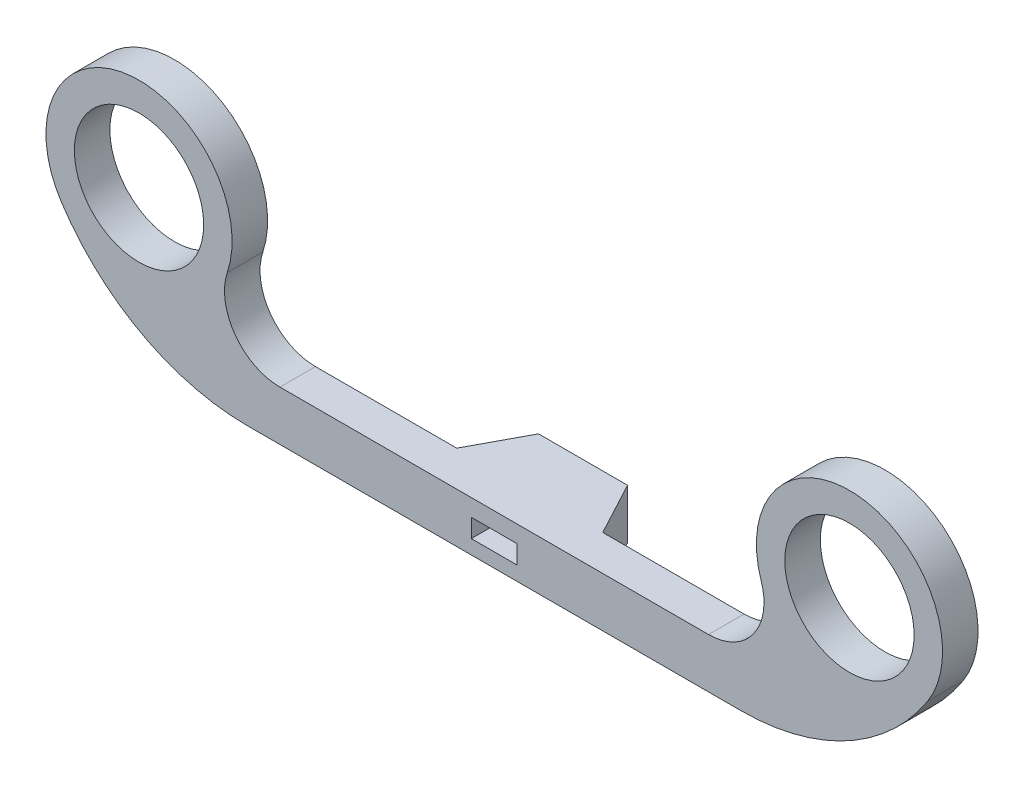
ISO-10303-21;
HEADER;
FILE_DESCRIPTION(('STEP AP214'),'2;1');
FILE_NAME('part.step','',(''),(''),'','','');
FILE_SCHEMA(('AUTOMOTIVE_DESIGN { 1 0 10303 214 1 1 1 1 }'));
ENDSEC;
DATA;
#1=APPLICATION_CONTEXT('core data for automotive mechanical design processes');
#2=APPLICATION_PROTOCOL_DEFINITION('international standard','automotive_design',2000,#1);
#3=PRODUCT_CONTEXT('',#1,'mechanical');
#4=PRODUCT('Part','Part','',(#3));
#5=PRODUCT_RELATED_PRODUCT_CATEGORY('part','',(#4));
#6=PRODUCT_DEFINITION_FORMATION('','',#4);
#7=PRODUCT_DEFINITION_CONTEXT('part definition',#1,'design');
#8=PRODUCT_DEFINITION('design','',#6,#7);
#9=PRODUCT_DEFINITION_SHAPE('','',#8);
#10=(LENGTH_UNIT() NAMED_UNIT(*) SI_UNIT(.MILLI.,.METRE.));
#11=(NAMED_UNIT(*) PLANE_ANGLE_UNIT() SI_UNIT($,.RADIAN.));
#12=(NAMED_UNIT(*) SI_UNIT($,.STERADIAN.) SOLID_ANGLE_UNIT());
#13=UNCERTAINTY_MEASURE_WITH_UNIT(LENGTH_MEASURE(1.E-05),#10,'distance_accuracy_value','');
#14=(GEOMETRIC_REPRESENTATION_CONTEXT(3) GLOBAL_UNCERTAINTY_ASSIGNED_CONTEXT((#13)) GLOBAL_UNIT_ASSIGNED_CONTEXT((#10,
#11,#12)) REPRESENTATION_CONTEXT('',''));
#15=CARTESIAN_POINT('',(0.,0.,0.));
#16=DIRECTION('',(0.,0.,1.));
#17=DIRECTION('',(1.,0.,0.));
#18=AXIS2_PLACEMENT_3D('',#15,#16,#17);
#19=CARTESIAN_POINT('',(-22.0565188033917,38.0288547062897,12.7));
#20=DIRECTION('',(0.,0.,-1.));
#21=DIRECTION('',(-1.,0.,0.));
#22=AXIS2_PLACEMENT_3D('',#19,#20,#21);
#23=CYLINDRICAL_SURFACE('',#22,19.8678547062897);
#24=CARTESIAN_POINT('',(-22.0565188033917,38.0288547062897,9.525));
#25=DIRECTION('',(0.,0.,-1.));
#26=DIRECTION('',(-1.,0.,0.));
#27=AXIS2_PLACEMENT_3D('',#24,#25,#26);
#28=CIRCLE('',#27,19.8678547062897);
#29=CARTESIAN_POINT('',(-22.0565188033917,18.161,9.525));
#30=VERTEX_POINT('',#29);
#31=CARTESIAN_POINT('',(-38.7317946876351,27.2276128881187,9.525));
#32=VERTEX_POINT('',#31);
#33=EDGE_CURVE('E49',#30,#32,#28,.T.);
#34=ORIENTED_EDGE('',*,*,#33,.F.);
#35=DIRECTION('',(0.,0.,-1.));
#36=VECTOR('',#35,1.);
#37=CARTESIAN_POINT('',(-22.0565188033917,18.161,12.7));
#38=LINE('',#37,#36);
#39=CARTESIAN_POINT('',(-22.0565188033917,18.161,12.7));
#40=VERTEX_POINT('',#39);
#41=EDGE_CURVE('E223',#40,#30,#38,.T.);
#42=ORIENTED_EDGE('',*,*,#41,.F.);
#43=CARTESIAN_POINT('',(-22.0565188033917,38.0288547062897,12.7));
#44=DIRECTION('',(0.,0.,1.));
#45=DIRECTION('',(1.,0.,0.));
#46=AXIS2_PLACEMENT_3D('',#43,#44,#45);
#47=CIRCLE('',#46,19.8678547062897);
#48=CARTESIAN_POINT('',(-38.7317946876351,27.2276128881187,12.7));
#49=VERTEX_POINT('',#48);
#50=EDGE_CURVE('E185',#49,#40,#47,.T.);
#51=ORIENTED_EDGE('',*,*,#50,.F.);
#52=DIRECTION('',(0.,0.,-1.));
#53=VECTOR('',#52,1.);
#54=CARTESIAN_POINT('',(-38.7317946876351,27.2276128881187,12.7));
#55=LINE('',#54,#53);
#56=EDGE_CURVE('E202',#49,#32,#55,.T.);
#57=ORIENTED_EDGE('',*,*,#56,.T.);
#58=EDGE_LOOP('',(#34,#42,#51,#57));
#59=FACE_BOUND('',#58,.T.);
#60=ADVANCED_FACE('F35',(#59),#23,.T.);
#61=CARTESIAN_POINT('',(-22.0565188033917,18.161,12.7));
#62=DIRECTION('',(0.,1.,0.));
#63=DIRECTION('',(0.,0.,1.));
#64=AXIS2_PLACEMENT_3D('',#61,#62,#63);
#65=PLANE('',#64);
#66=DIRECTION('',(-1.,0.,0.));
#67=VECTOR('',#66,1.);
#68=CARTESIAN_POINT('',(-46.1574002867593,18.161,9.525));
#69=LINE('',#68,#67);
#70=CARTESIAN_POINT('',(-6.52465554349035,18.161,9.525));
#71=VERTEX_POINT('',#70);
#72=EDGE_CURVE('E152',#71,#30,#69,.T.);
#73=ORIENTED_EDGE('',*,*,#72,.F.);
#74=DIRECTION('',(-0.471463323028111,0.,0.88188567004986));
#75=VECTOR('',#74,1.);
#76=CARTESIAN_POINT('',(-6.52465554349035,18.161,9.525));
#77=LINE('',#76,#75);
#78=CARTESIAN_POINT('',(-3.97858392425832,18.161,4.7625));
#79=VERTEX_POINT('',#78);
#80=EDGE_CURVE('E305',#79,#71,#77,.T.);
#81=ORIENTED_EDGE('',*,*,#80,.F.);
#82=DIRECTION('',(-1.,0.,0.));
#83=VECTOR('',#82,1.);
#84=CARTESIAN_POINT('',(-3.97858392425832,18.161,4.7625));
#85=LINE('',#84,#83);
#86=CARTESIAN_POINT('',(3.97858392425832,18.161,4.7625));
#87=VERTEX_POINT('',#86);
#88=EDGE_CURVE('E309',#87,#79,#85,.T.);
#89=ORIENTED_EDGE('',*,*,#88,.F.);
#90=DIRECTION('',(-0.471463323028111,0.,-0.88188567004986));
#91=VECTOR('',#90,1.);
#92=CARTESIAN_POINT('',(3.97858392425832,18.161,4.7625));
#93=LINE('',#92,#91);
#94=CARTESIAN_POINT('',(6.52465554349035,18.161,9.525));
#95=VERTEX_POINT('',#94);
#96=EDGE_CURVE('E314',#95,#87,#93,.T.);
#97=ORIENTED_EDGE('',*,*,#96,.F.);
#98=DIRECTION('',(-1.,0.,0.));
#99=VECTOR('',#98,1.);
#100=CARTESIAN_POINT('',(6.52465554349035,18.161,9.525));
#101=LINE('',#100,#99);
#102=CARTESIAN_POINT('',(22.0565188033917,18.161,9.525));
#103=VERTEX_POINT('',#102);
#104=EDGE_CURVE('E251',#103,#95,#101,.T.);
#105=ORIENTED_EDGE('',*,*,#104,.F.);
#106=DIRECTION('',(0.,0.,-1.));
#107=VECTOR('',#106,1.);
#108=CARTESIAN_POINT('',(22.0565188033917,18.161,12.7));
#109=LINE('',#108,#107);
#110=CARTESIAN_POINT('',(22.0565188033917,18.161,12.7));
#111=VERTEX_POINT('',#110);
#112=EDGE_CURVE('E220',#111,#103,#109,.T.);
#113=ORIENTED_EDGE('',*,*,#112,.F.);
#114=DIRECTION('',(1.,0.,0.));
#115=VECTOR('',#114,1.);
#116=CARTESIAN_POINT('',(-22.0565188033917,18.161,12.7));
#117=LINE('',#116,#115);
#118=EDGE_CURVE('E188',#40,#111,#117,.T.);
#119=ORIENTED_EDGE('',*,*,#118,.F.);
#120=ORIENTED_EDGE('',*,*,#41,.T.);
#121=EDGE_LOOP('',(#73,#81,#89,#97,#105,#113,#119,#120));
#122=FACE_BOUND('',#121,.T.);
#123=ADVANCED_FACE('F311',(#122),#65,.F.);
#124=CARTESIAN_POINT('',(22.0565188033917,38.0288547062896,12.7));
#125=DIRECTION('',(0.,0.,-1.));
#126=DIRECTION('',(-1.,0.,0.));
#127=AXIS2_PLACEMENT_3D('',#124,#125,#126);
#128=CYLINDRICAL_SURFACE('',#127,19.8678547062896);
#129=CARTESIAN_POINT('',(22.0565188033917,38.0288547062896,9.525));
#130=DIRECTION('',(0.,0.,-1.));
#131=DIRECTION('',(-1.,0.,0.));
#132=AXIS2_PLACEMENT_3D('',#129,#130,#131);
#133=CIRCLE('',#132,19.8678547062896);
#134=CARTESIAN_POINT('',(38.7317946876351,27.2276128881187,9.525));
#135=VERTEX_POINT('',#134);
#136=EDGE_CURVE('E234',#135,#103,#133,.T.);
#137=ORIENTED_EDGE('',*,*,#136,.F.);
#138=DIRECTION('',(0.,0.,-1.));
#139=VECTOR('',#138,1.);
#140=CARTESIAN_POINT('',(38.7317946876351,27.2276128881187,12.7));
#141=LINE('',#140,#139);
#142=CARTESIAN_POINT('',(38.7317946876351,27.2276128881187,12.7));
#143=VERTEX_POINT('',#142);
#144=EDGE_CURVE('E217',#143,#135,#141,.T.);
#145=ORIENTED_EDGE('',*,*,#144,.F.);
#146=CARTESIAN_POINT('',(22.0565188033917,38.0288547062896,12.7));
#147=DIRECTION('',(0.,0.,1.));
#148=DIRECTION('',(1.,0.,0.));
#149=AXIS2_PLACEMENT_3D('',#146,#147,#148);
#150=CIRCLE('',#149,19.8678547062896);
#151=EDGE_CURVE('E190',#111,#143,#150,.T.);
#152=ORIENTED_EDGE('',*,*,#151,.F.);
#153=ORIENTED_EDGE('',*,*,#112,.T.);
#154=EDGE_LOOP('',(#137,#145,#152,#153));
#155=FACE_BOUND('',#154,.T.);
#156=ADVANCED_FACE('F322',(#155),#128,.T.);
#157=CARTESIAN_POINT('',(31.75,31.75,12.7));
#158=DIRECTION('',(0.,0.,-1.));
#159=DIRECTION('',(-1.,0.,0.));
#160=AXIS2_PLACEMENT_3D('',#157,#158,#159);
#161=CYLINDRICAL_SURFACE('',#160,8.3185);
#162=CARTESIAN_POINT('',(31.75,31.75,9.525));
#163=DIRECTION('',(0.,0.,-1.));
#164=DIRECTION('',(-1.,0.,0.));
#165=AXIS2_PLACEMENT_3D('',#162,#163,#164);
#166=CIRCLE('',#165,8.3185);
#167=CARTESIAN_POINT('',(23.8559678373124,29.1267008435075,9.525));
#168=VERTEX_POINT('',#167);
#169=EDGE_CURVE('E260',#168,#135,#166,.T.);
#170=ORIENTED_EDGE('',*,*,#169,.F.);
#171=DIRECTION('',(0.,0.,-1.));
#172=VECTOR('',#171,1.);
#173=CARTESIAN_POINT('',(23.8559678373124,29.1267008435075,12.7));
#174=LINE('',#173,#172);
#175=CARTESIAN_POINT('',(23.8559678373124,29.1267008435075,12.7));
#176=VERTEX_POINT('',#175);
#177=EDGE_CURVE('E214',#176,#168,#174,.T.);
#178=ORIENTED_EDGE('',*,*,#177,.F.);
#179=CARTESIAN_POINT('',(31.75,31.75,12.7));
#180=DIRECTION('',(0.,0.,1.));
#181=DIRECTION('',(1.,0.,0.));
#182=AXIS2_PLACEMENT_3D('',#179,#180,#181);
#183=CIRCLE('',#182,8.3185);
#184=EDGE_CURVE('E192',#143,#176,#183,.T.);
#185=ORIENTED_EDGE('',*,*,#184,.F.);
#186=ORIENTED_EDGE('',*,*,#144,.T.);
#187=EDGE_LOOP('',(#170,#178,#185,#186));
#188=FACE_BOUND('',#187,.T.);
#189=ADVANCED_FACE('F344',(#188),#161,.T.);
#190=CARTESIAN_POINT('',(19.1515658056439,27.5633611424344,12.7));
#191=DIRECTION('',(0.,0.,-1.));
#192=DIRECTION('',(-1.,0.,0.));
#193=AXIS2_PLACEMENT_3D('',#190,#191,#192);
#194=CYLINDRICAL_SURFACE('',#193,4.95736114243437);
#195=CARTESIAN_POINT('',(19.1515658056439,27.5633611424344,9.525));
#196=DIRECTION('',(0.,0.,-1.));
#197=DIRECTION('',(-1.,0.,0.));
#198=AXIS2_PLACEMENT_3D('',#195,#196,#197);
#199=CIRCLE('',#198,4.95736114243437);
#200=CARTESIAN_POINT('',(19.1515658056439,22.606,9.525));
#201=VERTEX_POINT('',#200);
#202=EDGE_CURVE('E258',#201,#168,#199,.F.);
#203=ORIENTED_EDGE('',*,*,#202,.F.);
#204=DIRECTION('',(0.,0.,-1.));
#205=VECTOR('',#204,1.);
#206=CARTESIAN_POINT('',(19.1515658056439,22.606,12.7));
#207=LINE('',#206,#205);
#208=CARTESIAN_POINT('',(19.1515658056439,22.606,12.7));
#209=VERTEX_POINT('',#208);
#210=EDGE_CURVE('E211',#209,#201,#207,.T.);
#211=ORIENTED_EDGE('',*,*,#210,.F.);
#212=CARTESIAN_POINT('',(19.1515658056439,27.5633611424344,12.7));
#213=DIRECTION('',(0.,0.,-1.));
#214=DIRECTION('',(1.,0.,0.));
#215=AXIS2_PLACEMENT_3D('',#212,#213,#214);
#216=CIRCLE('',#215,4.95736114243437);
#217=EDGE_CURVE('E194',#176,#209,#216,.T.);
#218=ORIENTED_EDGE('',*,*,#217,.F.);
#219=ORIENTED_EDGE('',*,*,#177,.T.);
#220=EDGE_LOOP('',(#203,#211,#218,#219));
#221=FACE_BOUND('',#220,.T.);
#222=ADVANCED_FACE('F342',(#221),#194,.F.);
#223=CARTESIAN_POINT('',(-19.1515658056439,22.606,12.7));
#224=DIRECTION('',(0.,-1.,0.));
#225=DIRECTION('',(0.,0.,-1.));
#226=AXIS2_PLACEMENT_3D('',#223,#224,#225);
#227=PLANE('',#226);
#228=DIRECTION('',(1.,0.,0.));
#229=VECTOR('',#228,1.);
#230=CARTESIAN_POINT('',(-19.1515658056439,22.606,9.525));
#231=LINE('',#230,#229);
#232=CARTESIAN_POINT('',(-19.1515658056439,22.606,9.525));
#233=VERTEX_POINT('',#232);
#234=CARTESIAN_POINT('',(-6.52465554349035,22.606,9.525));
#235=VERTEX_POINT('',#234);
#236=EDGE_CURVE('E272',#233,#235,#231,.T.);
#237=ORIENTED_EDGE('',*,*,#236,.F.);
#238=DIRECTION('',(0.,0.,-1.));
#239=VECTOR('',#238,1.);
#240=CARTESIAN_POINT('',(-19.1515658056439,22.606,12.7));
#241=LINE('',#240,#239);
#242=CARTESIAN_POINT('',(-19.1515658056439,22.606,12.7));
#243=VERTEX_POINT('',#242);
#244=EDGE_CURVE('E208',#243,#233,#241,.T.);
#245=ORIENTED_EDGE('',*,*,#244,.F.);
#246=DIRECTION('',(-1.,0.,0.));
#247=VECTOR('',#246,1.);
#248=CARTESIAN_POINT('',(-19.1515658056439,22.606,12.7));
#249=LINE('',#248,#247);
#250=EDGE_CURVE('E196',#209,#243,#249,.T.);
#251=ORIENTED_EDGE('',*,*,#250,.F.);
#252=ORIENTED_EDGE('',*,*,#210,.T.);
#253=DIRECTION('',(1.,0.,0.));
#254=VECTOR('',#253,1.);
#255=CARTESIAN_POINT('',(-19.1515658056439,22.606,9.525));
#256=LINE('',#255,#254);
#257=CARTESIAN_POINT('',(6.52465554349035,22.606,9.525));
#258=VERTEX_POINT('',#257);
#259=EDGE_CURVE('E229',#258,#201,#256,.T.);
#260=ORIENTED_EDGE('',*,*,#259,.F.);
#261=DIRECTION('',(0.471463323028111,0.,0.88188567004986));
#262=VECTOR('',#261,1.);
#263=CARTESIAN_POINT('',(2.13749619358142,22.606,1.3186925866039));
#264=LINE('',#263,#262);
#265=CARTESIAN_POINT('',(3.97858392425832,22.606,4.7625));
#266=VERTEX_POINT('',#265);
#267=EDGE_CURVE('E42',#266,#258,#264,.T.);
#268=ORIENTED_EDGE('',*,*,#267,.F.);
#269=DIRECTION('',(1.,0.,0.));
#270=VECTOR('',#269,1.);
#271=CARTESIAN_POINT('',(-19.1515658056439,22.606,4.7625));
#272=LINE('',#271,#270);
#273=CARTESIAN_POINT('',(-3.97858392425832,22.606,4.7625));
#274=VERTEX_POINT('',#273);
#275=EDGE_CURVE('E230',#274,#266,#272,.T.);
#276=ORIENTED_EDGE('',*,*,#275,.F.);
#277=DIRECTION('',(0.471463323028111,0.,-0.88188567004986));
#278=VECTOR('',#277,1.);
#279=CARTESIAN_POINT('',(-10.6514268488212,22.606,17.2442441065606));
#280=LINE('',#279,#278);
#281=EDGE_CURVE('E11',#235,#274,#280,.T.);
#282=ORIENTED_EDGE('',*,*,#281,.F.);
#283=EDGE_LOOP('',(#237,#245,#251,#252,#260,#268,#276,#282));
#284=FACE_BOUND('',#283,.T.);
#285=ADVANCED_FACE('F255',(#284),#227,.F.);
#286=CARTESIAN_POINT('',(-19.1515658056439,27.5633611424344,12.7));
#287=DIRECTION('',(0.,0.,-1.));
#288=DIRECTION('',(-1.,0.,0.));
#289=AXIS2_PLACEMENT_3D('',#286,#287,#288);
#290=CYLINDRICAL_SURFACE('',#289,4.95736114243437);
#291=CARTESIAN_POINT('',(-19.1515658056439,27.5633611424344,9.525));
#292=DIRECTION('',(0.,0.,-1.));
#293=DIRECTION('',(-1.,0.,0.));
#294=AXIS2_PLACEMENT_3D('',#291,#292,#293);
#295=CIRCLE('',#294,4.95736114243437);
#296=CARTESIAN_POINT('',(-23.8559678373124,29.1267008435075,9.525));
#297=VERTEX_POINT('',#296);
#298=EDGE_CURVE('E270',#297,#233,#295,.F.);
#299=ORIENTED_EDGE('',*,*,#298,.F.);
#300=DIRECTION('',(0.,0.,-1.));
#301=VECTOR('',#300,1.);
#302=CARTESIAN_POINT('',(-23.8559678373124,29.1267008435075,12.7));
#303=LINE('',#302,#301);
#304=CARTESIAN_POINT('',(-23.8559678373124,29.1267008435075,12.7));
#305=VERTEX_POINT('',#304);
#306=EDGE_CURVE('E205',#305,#297,#303,.T.);
#307=ORIENTED_EDGE('',*,*,#306,.F.);
#308=CARTESIAN_POINT('',(-19.1515658056439,27.5633611424344,12.7));
#309=DIRECTION('',(0.,0.,-1.));
#310=DIRECTION('',(-1.,0.,0.));
#311=AXIS2_PLACEMENT_3D('',#308,#309,#310);
#312=CIRCLE('',#311,4.95736114243437);
#313=EDGE_CURVE('E198',#243,#305,#312,.T.);
#314=ORIENTED_EDGE('',*,*,#313,.F.);
#315=ORIENTED_EDGE('',*,*,#244,.T.);
#316=EDGE_LOOP('',(#299,#307,#314,#315));
#317=FACE_BOUND('',#316,.T.);
#318=ADVANCED_FACE('F338',(#317),#290,.F.);
#319=CARTESIAN_POINT('',(-31.75,31.75,12.7));
#320=DIRECTION('',(0.,0.,-1.));
#321=DIRECTION('',(-1.,0.,0.));
#322=AXIS2_PLACEMENT_3D('',#319,#320,#321);
#323=CYLINDRICAL_SURFACE('',#322,8.3185);
#324=ORIENTED_EDGE('',*,*,#306,.T.);
#325=CARTESIAN_POINT('',(-31.75,31.75,9.525));
#326=DIRECTION('',(0.,0.,-1.));
#327=DIRECTION('',(-1.,0.,0.));
#328=AXIS2_PLACEMENT_3D('',#325,#326,#327);
#329=CIRCLE('',#328,8.3185);
#330=EDGE_CURVE('E233',#32,#297,#329,.T.);
#331=ORIENTED_EDGE('',*,*,#330,.F.);
#332=ORIENTED_EDGE('',*,*,#56,.F.);
#333=CARTESIAN_POINT('',(-31.75,31.75,12.7));
#334=DIRECTION('',(0.,0.,1.));
#335=DIRECTION('',(1.,0.,0.));
#336=AXIS2_PLACEMENT_3D('',#333,#334,#335);
#337=CIRCLE('',#336,8.3185);
#338=EDGE_CURVE('E200',#305,#49,#337,.T.);
#339=ORIENTED_EDGE('',*,*,#338,.F.);
#340=EDGE_LOOP('',(#324,#331,#332,#339));
#341=FACE_BOUND('',#340,.T.);
#342=ADVANCED_FACE('F333',(#341),#323,.T.);
#343=CARTESIAN_POINT('',(-31.75,31.75,12.7));
#344=DIRECTION('',(0.,0.,-1.));
#345=DIRECTION('',(-1.,0.,0.));
#346=AXIS2_PLACEMENT_3D('',#343,#344,#345);
#347=CYLINDRICAL_SURFACE('',#346,5.7785);
#348=CARTESIAN_POINT('',(-31.75,31.75,12.7));
#349=DIRECTION('',(0.,0.,1.));
#350=DIRECTION('',(1.,0.,0.));
#351=AXIS2_PLACEMENT_3D('',#348,#349,#350);
#352=CIRCLE('',#351,5.7785);
#353=CARTESIAN_POINT('',(-25.9715,31.75,12.7));
#354=VERTEX_POINT('',#353);
#355=EDGE_CURVE('E182',#354,#354,#352,.T.);
#356=ORIENTED_EDGE('',*,*,#355,.T.);
#357=EDGE_LOOP('',(#356));
#358=FACE_BOUND('',#357,.T.);
#359=CARTESIAN_POINT('',(-31.75,31.75,9.525));
#360=DIRECTION('',(0.,0.,-1.));
#361=DIRECTION('',(-1.,0.,0.));
#362=AXIS2_PLACEMENT_3D('',#359,#360,#361);
#363=CIRCLE('',#362,5.7785);
#364=CARTESIAN_POINT('',(-37.5285,31.75,9.525));
#365=VERTEX_POINT('',#364);
#366=EDGE_CURVE('E231',#365,#365,#363,.T.);
#367=ORIENTED_EDGE('',*,*,#366,.T.);
#368=EDGE_LOOP('',(#367));
#369=FACE_BOUND('',#368,.T.);
#370=ADVANCED_FACE('F398',(#358,#369),#347,.F.);
#371=CARTESIAN_POINT('',(31.75,31.75,12.7));
#372=DIRECTION('',(0.,0.,-1.));
#373=DIRECTION('',(-1.,0.,0.));
#374=AXIS2_PLACEMENT_3D('',#371,#372,#373);
#375=CYLINDRICAL_SURFACE('',#374,5.7785);
#376=CARTESIAN_POINT('',(31.75,31.75,12.7));
#377=DIRECTION('',(0.,0.,1.));
#378=DIRECTION('',(1.,0.,0.));
#379=AXIS2_PLACEMENT_3D('',#376,#377,#378);
#380=CIRCLE('',#379,5.7785);
#381=CARTESIAN_POINT('',(37.5285,31.75,12.7));
#382=VERTEX_POINT('',#381);
#383=EDGE_CURVE('E179',#382,#382,#380,.T.);
#384=ORIENTED_EDGE('',*,*,#383,.T.);
#385=EDGE_LOOP('',(#384));
#386=FACE_BOUND('',#385,.T.);
#387=CARTESIAN_POINT('',(31.75,31.75,9.525));
#388=DIRECTION('',(0.,0.,-1.));
#389=DIRECTION('',(-1.,0.,0.));
#390=AXIS2_PLACEMENT_3D('',#387,#388,#389);
#391=CIRCLE('',#390,5.7785);
#392=CARTESIAN_POINT('',(25.9715,31.75,9.525));
#393=VERTEX_POINT('',#392);
#394=EDGE_CURVE('E226',#393,#393,#391,.T.);
#395=ORIENTED_EDGE('',*,*,#394,.T.);
#396=EDGE_LOOP('',(#395));
#397=FACE_BOUND('',#396,.T.);
#398=ADVANCED_FACE('F407',(#386,#397),#375,.F.);
#399=CARTESIAN_POINT('',(2.05,21.082,12.7));
#400=DIRECTION('',(-1.,0.,0.));
#401=DIRECTION('',(0.,0.,1.));
#402=AXIS2_PLACEMENT_3D('',#399,#400,#401);
#403=PLANE('',#402);
#404=DIRECTION('',(0.,0.,-1.));
#405=VECTOR('',#404,1.);
#406=CARTESIAN_POINT('',(2.05,21.082,12.7));
#407=LINE('',#406,#405);
#408=CARTESIAN_POINT('',(2.05,21.082,12.7));
#409=VERTEX_POINT('',#408);
#410=CARTESIAN_POINT('',(2.05,21.082,4.7625));
#411=VERTEX_POINT('',#410);
#412=EDGE_CURVE('E161',#409,#411,#407,.T.);
#413=ORIENTED_EDGE('',*,*,#412,.T.);
#414=DIRECTION('',(0.,-1.,0.));
#415=VECTOR('',#414,1.);
#416=CARTESIAN_POINT('',(2.05,18.16,4.7625));
#417=LINE('',#416,#415);
#418=CARTESIAN_POINT('',(2.05,19.431,4.7625));
#419=VERTEX_POINT('',#418);
#420=EDGE_CURVE('E147',#411,#419,#417,.T.);
#421=ORIENTED_EDGE('',*,*,#420,.T.);
#422=DIRECTION('',(0.,0.,-1.));
#423=VECTOR('',#422,1.);
#424=CARTESIAN_POINT('',(2.05,19.431,12.7));
#425=LINE('',#424,#423);
#426=CARTESIAN_POINT('',(2.05,19.431,12.7));
#427=VERTEX_POINT('',#426);
#428=EDGE_CURVE('E158',#427,#419,#425,.T.);
#429=ORIENTED_EDGE('',*,*,#428,.F.);
#430=DIRECTION('',(0.,1.,0.));
#431=VECTOR('',#430,1.);
#432=CARTESIAN_POINT('',(2.05,21.082,12.7));
#433=LINE('',#432,#431);
#434=EDGE_CURVE('E275',#427,#409,#433,.T.);
#435=ORIENTED_EDGE('',*,*,#434,.T.);
#436=EDGE_LOOP('',(#413,#421,#429,#435));
#437=FACE_BOUND('',#436,.T.);
#438=ADVANCED_FACE('F157',(#437),#403,.T.);
#439=CARTESIAN_POINT('',(-2.05,21.082,12.7));
#440=DIRECTION('',(0.,-1.,0.));
#441=DIRECTION('',(0.,0.,-1.));
#442=AXIS2_PLACEMENT_3D('',#439,#440,#441);
#443=PLANE('',#442);
#444=DIRECTION('',(0.,0.,-1.));
#445=VECTOR('',#444,1.);
#446=CARTESIAN_POINT('',(-2.05,21.082,12.7));
#447=LINE('',#446,#445);
#448=CARTESIAN_POINT('',(-2.05,21.082,12.7));
#449=VERTEX_POINT('',#448);
#450=CARTESIAN_POINT('',(-2.05,21.082,4.7625));
#451=VERTEX_POINT('',#450);
#452=EDGE_CURVE('E170',#449,#451,#447,.T.);
#453=ORIENTED_EDGE('',*,*,#452,.T.);
#454=DIRECTION('',(1.,0.,0.));
#455=VECTOR('',#454,1.);
#456=CARTESIAN_POINT('',(-3.97858392425832,21.082,4.7625));
#457=LINE('',#456,#455);
#458=EDGE_CURVE('E163',#451,#411,#457,.T.);
#459=ORIENTED_EDGE('',*,*,#458,.T.);
#460=ORIENTED_EDGE('',*,*,#412,.F.);
#461=DIRECTION('',(-1.,0.,0.));
#462=VECTOR('',#461,1.);
#463=CARTESIAN_POINT('',(-2.05,21.082,12.7));
#464=LINE('',#463,#462);
#465=EDGE_CURVE('E279',#409,#449,#464,.T.);
#466=ORIENTED_EDGE('',*,*,#465,.T.);
#467=EDGE_LOOP('',(#453,#459,#460,#466));
#468=FACE_BOUND('',#467,.T.);
#469=ADVANCED_FACE('F289',(#468),#443,.T.);
#470=CARTESIAN_POINT('',(-2.05,21.082,12.7));
#471=DIRECTION('',(1.,0.,0.));
#472=DIRECTION('',(0.,0.,-1.));
#473=AXIS2_PLACEMENT_3D('',#470,#471,#472);
#474=PLANE('',#473);
#475=DIRECTION('',(0.,0.,-1.));
#476=VECTOR('',#475,1.);
#477=CARTESIAN_POINT('',(-2.05,19.431,12.7));
#478=LINE('',#477,#476);
#479=CARTESIAN_POINT('',(-2.05,19.431,12.7));
#480=VERTEX_POINT('',#479);
#481=CARTESIAN_POINT('',(-2.05,19.431,4.7625));
#482=VERTEX_POINT('',#481);
#483=EDGE_CURVE('E168',#480,#482,#478,.T.);
#484=ORIENTED_EDGE('',*,*,#483,.T.);
#485=DIRECTION('',(0.,1.,0.));
#486=VECTOR('',#485,1.);
#487=CARTESIAN_POINT('',(-2.05,18.16,4.7625));
#488=LINE('',#487,#486);
#489=EDGE_CURVE('E57',#482,#451,#488,.T.);
#490=ORIENTED_EDGE('',*,*,#489,.T.);
#491=ORIENTED_EDGE('',*,*,#452,.F.);
#492=DIRECTION('',(0.,-1.,0.));
#493=VECTOR('',#492,1.);
#494=CARTESIAN_POINT('',(-2.05,21.082,12.7));
#495=LINE('',#494,#493);
#496=EDGE_CURVE('E172',#449,#480,#495,.T.);
#497=ORIENTED_EDGE('',*,*,#496,.T.);
#498=EDGE_LOOP('',(#484,#490,#491,#497));
#499=FACE_BOUND('',#498,.T.);
#500=ADVANCED_FACE('F284',(#499),#474,.T.);
#501=CARTESIAN_POINT('',(-2.05,19.431,12.7));
#502=DIRECTION('',(0.,1.,0.));
#503=DIRECTION('',(0.,0.,1.));
#504=AXIS2_PLACEMENT_3D('',#501,#502,#503);
#505=PLANE('',#504);
#506=ORIENTED_EDGE('',*,*,#428,.T.);
#507=DIRECTION('',(-1.,0.,0.));
#508=VECTOR('',#507,1.);
#509=CARTESIAN_POINT('',(-3.97858392425832,19.431,4.7625));
#510=LINE('',#509,#508);
#511=EDGE_CURVE('E143',#419,#482,#510,.T.);
#512=ORIENTED_EDGE('',*,*,#511,.T.);
#513=ORIENTED_EDGE('',*,*,#483,.F.);
#514=DIRECTION('',(1.,0.,0.));
#515=VECTOR('',#514,1.);
#516=CARTESIAN_POINT('',(-2.05,19.431,12.7));
#517=LINE('',#516,#515);
#518=EDGE_CURVE('E167',#480,#427,#517,.T.);
#519=ORIENTED_EDGE('',*,*,#518,.T.);
#520=EDGE_LOOP('',(#506,#512,#513,#519));
#521=FACE_BOUND('',#520,.T.);
#522=ADVANCED_FACE('F165',(#521),#505,.T.);
#523=CARTESIAN_POINT('',(-22.0565188033917,38.0288547062897,12.7));
#524=DIRECTION('',(0.,0.,1.));
#525=DIRECTION('',(1.,0.,0.));
#526=AXIS2_PLACEMENT_3D('',#523,#524,#525);
#527=PLANE('',#526);
#528=ORIENTED_EDGE('',*,*,#383,.F.);
#529=EDGE_LOOP('',(#528));
#530=FACE_BOUND('',#529,.T.);
#531=ORIENTED_EDGE('',*,*,#50,.T.);
#532=ORIENTED_EDGE('',*,*,#118,.T.);
#533=ORIENTED_EDGE('',*,*,#151,.T.);
#534=ORIENTED_EDGE('',*,*,#184,.T.);
#535=ORIENTED_EDGE('',*,*,#217,.T.);
#536=ORIENTED_EDGE('',*,*,#250,.T.);
#537=ORIENTED_EDGE('',*,*,#313,.T.);
#538=ORIENTED_EDGE('',*,*,#338,.T.);
#539=EDGE_LOOP('',(#531,#532,#533,#534,#535,#536,#537,#538));
#540=FACE_BOUND('',#539,.T.);
#541=ORIENTED_EDGE('',*,*,#355,.F.);
#542=EDGE_LOOP('',(#541));
#543=FACE_BOUND('',#542,.T.);
#544=ORIENTED_EDGE('',*,*,#465,.F.);
#545=ORIENTED_EDGE('',*,*,#434,.F.);
#546=ORIENTED_EDGE('',*,*,#518,.F.);
#547=ORIENTED_EDGE('',*,*,#496,.F.);
#548=EDGE_LOOP('',(#544,#545,#546,#547));
#549=FACE_BOUND('',#548,.T.);
#550=ADVANCED_FACE('F287',(#530,#540,#543,#549),#527,.T.);
#551=CARTESIAN_POINT('',(-6.52465554349035,40.0685,9.525));
#552=DIRECTION('',(-0.88188567004986,0.,-0.471463323028111));
#553=DIRECTION('',(-0.471463323028111,0.,0.88188567004986));
#554=AXIS2_PLACEMENT_3D('',#551,#552,#553);
#555=PLANE('',#554);
#556=ORIENTED_EDGE('',*,*,#281,.T.);
#557=DIRECTION('',(0.,-1.,0.));
#558=VECTOR('',#557,1.);
#559=CARTESIAN_POINT('',(-3.97858392425832,40.0685,4.7625));
#560=LINE('',#559,#558);
#561=EDGE_CURVE('E294',#274,#79,#560,.T.);
#562=ORIENTED_EDGE('',*,*,#561,.T.);
#563=ORIENTED_EDGE('',*,*,#80,.T.);
#564=DIRECTION('',(0.,-1.,0.));
#565=VECTOR('',#564,1.);
#566=CARTESIAN_POINT('',(-6.52465554349035,40.0685,9.525));
#567=LINE('',#566,#565);
#568=EDGE_CURVE('E295',#235,#71,#567,.T.);
#569=ORIENTED_EDGE('',*,*,#568,.F.);
#570=EDGE_LOOP('',(#556,#562,#563,#569));
#571=FACE_BOUND('',#570,.T.);
#572=ADVANCED_FACE('F303',(#571),#555,.T.);
#573=CARTESIAN_POINT('',(3.97858392425832,40.0685,4.7625));
#574=DIRECTION('',(0.88188567004986,0.,-0.471463323028111));
#575=DIRECTION('',(-0.471463323028111,0.,-0.88188567004986));
#576=AXIS2_PLACEMENT_3D('',#573,#574,#575);
#577=PLANE('',#576);
#578=ORIENTED_EDGE('',*,*,#267,.T.);
#579=DIRECTION('',(0.,-1.,0.));
#580=VECTOR('',#579,1.);
#581=CARTESIAN_POINT('',(6.52465554349035,40.0685,9.525));
#582=LINE('',#581,#580);
#583=EDGE_CURVE('E162',#258,#95,#582,.T.);
#584=ORIENTED_EDGE('',*,*,#583,.T.);
#585=ORIENTED_EDGE('',*,*,#96,.T.);
#586=DIRECTION('',(0.,-1.,0.));
#587=VECTOR('',#586,1.);
#588=CARTESIAN_POINT('',(3.97858392425832,40.0685,4.7625));
#589=LINE('',#588,#587);
#590=EDGE_CURVE('E242',#266,#87,#589,.T.);
#591=ORIENTED_EDGE('',*,*,#590,.F.);
#592=EDGE_LOOP('',(#578,#584,#585,#591));
#593=FACE_BOUND('',#592,.T.);
#594=ADVANCED_FACE('F239',(#593),#577,.T.);
#595=CARTESIAN_POINT('',(-46.1574002867593,40.0685,9.525));
#596=DIRECTION('',(0.,0.,-1.));
#597=DIRECTION('',(-1.,0.,0.));
#598=AXIS2_PLACEMENT_3D('',#595,#596,#597);
#599=PLANE('',#598);
#600=ORIENTED_EDGE('',*,*,#366,.F.);
#601=EDGE_LOOP('',(#600));
#602=FACE_BOUND('',#601,.T.);
#603=ORIENTED_EDGE('',*,*,#33,.T.);
#604=ORIENTED_EDGE('',*,*,#330,.T.);
#605=ORIENTED_EDGE('',*,*,#298,.T.);
#606=ORIENTED_EDGE('',*,*,#236,.T.);
#607=ORIENTED_EDGE('',*,*,#568,.T.);
#608=ORIENTED_EDGE('',*,*,#72,.T.);
#609=EDGE_LOOP('',(#603,#604,#605,#606,#607,#608));
#610=FACE_BOUND('',#609,.T.);
#611=ADVANCED_FACE('F336',(#602,#610),#599,.T.);
#612=CARTESIAN_POINT('',(6.52465554349035,40.0685,9.525));
#613=DIRECTION('',(0.,0.,-1.));
#614=DIRECTION('',(-1.,0.,0.));
#615=AXIS2_PLACEMENT_3D('',#612,#613,#614);
#616=PLANE('',#615);
#617=ORIENTED_EDGE('',*,*,#394,.F.);
#618=EDGE_LOOP('',(#617));
#619=FACE_BOUND('',#618,.T.);
#620=ORIENTED_EDGE('',*,*,#136,.T.);
#621=ORIENTED_EDGE('',*,*,#104,.T.);
#622=ORIENTED_EDGE('',*,*,#583,.F.);
#623=ORIENTED_EDGE('',*,*,#259,.T.);
#624=ORIENTED_EDGE('',*,*,#202,.T.);
#625=ORIENTED_EDGE('',*,*,#169,.T.);
#626=EDGE_LOOP('',(#620,#621,#622,#623,#624,#625));
#627=FACE_BOUND('',#626,.T.);
#628=ADVANCED_FACE('F247',(#619,#627),#616,.T.);
#629=CARTESIAN_POINT('',(-3.97858392425832,40.0685,4.7625));
#630=DIRECTION('',(0.,0.,-1.));
#631=DIRECTION('',(-1.,0.,0.));
#632=AXIS2_PLACEMENT_3D('',#629,#630,#631);
#633=PLANE('',#632);
#634=ORIENTED_EDGE('',*,*,#458,.F.);
#635=ORIENTED_EDGE('',*,*,#489,.F.);
#636=ORIENTED_EDGE('',*,*,#511,.F.);
#637=ORIENTED_EDGE('',*,*,#420,.F.);
#638=EDGE_LOOP('',(#634,#635,#636,#637));
#639=FACE_BOUND('',#638,.T.);
#640=ORIENTED_EDGE('',*,*,#275,.T.);
#641=ORIENTED_EDGE('',*,*,#590,.T.);
#642=ORIENTED_EDGE('',*,*,#88,.T.);
#643=ORIENTED_EDGE('',*,*,#561,.F.);
#644=EDGE_LOOP('',(#640,#641,#642,#643));
#645=FACE_BOUND('',#644,.T.);
#646=ADVANCED_FACE('F145',(#639,#645),#633,.T.);
#647=CLOSED_SHELL('',(#60,#123,#156,#189,#222,#285,#318,#342,#370,#398,#438,#469,#500,#522,#550,
#572,#594,#611,#628,#646));
#648=MANIFOLD_SOLID_BREP('B2',#647);
#649=ADVANCED_BREP_SHAPE_REPRESENTATION('',(#18,#648),#14);
#650=SHAPE_DEFINITION_REPRESENTATION(#9,#649);
ENDSEC;
END-ISO-10303-21;
